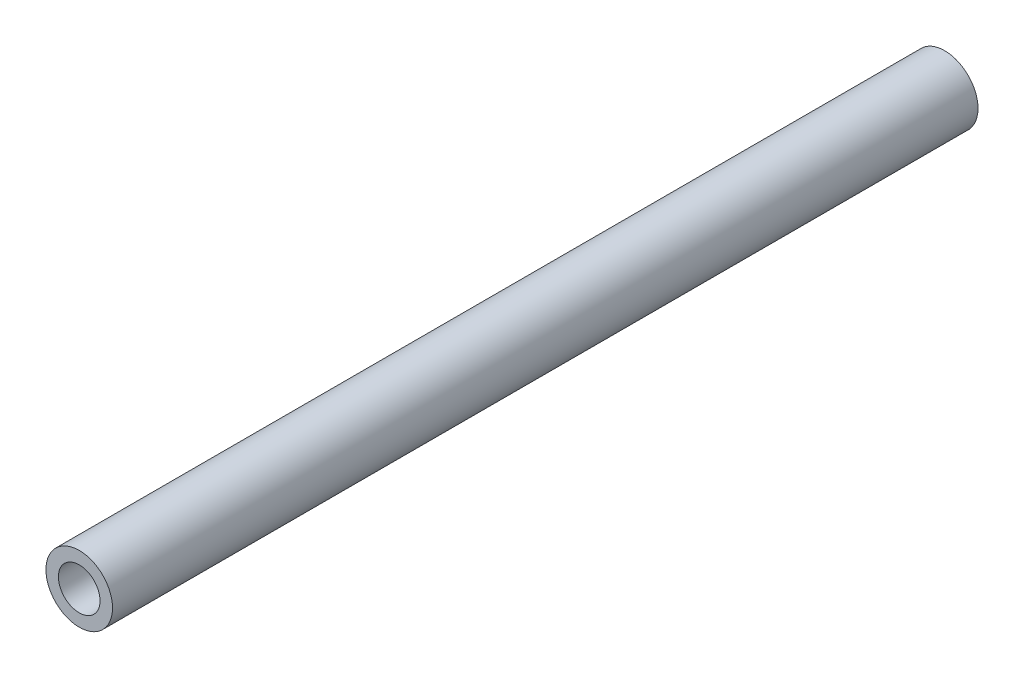
ISO-10303-21;
HEADER;
FILE_DESCRIPTION(('STEP AP214'),'2;1');
FILE_NAME('part.step','',(''),(''),'','','');
FILE_SCHEMA(('AUTOMOTIVE_DESIGN { 1 0 10303 214 1 1 1 1 }'));
ENDSEC;
DATA;
#1=APPLICATION_CONTEXT('core data for automotive mechanical design processes');
#2=APPLICATION_PROTOCOL_DEFINITION('international standard','automotive_design',2000,#1);
#3=PRODUCT_CONTEXT('',#1,'mechanical');
#4=PRODUCT('Part','Part','',(#3));
#5=PRODUCT_RELATED_PRODUCT_CATEGORY('part','',(#4));
#6=PRODUCT_DEFINITION_FORMATION('','',#4);
#7=PRODUCT_DEFINITION_CONTEXT('part definition',#1,'design');
#8=PRODUCT_DEFINITION('design','',#6,#7);
#9=PRODUCT_DEFINITION_SHAPE('','',#8);
#10=(LENGTH_UNIT() NAMED_UNIT(*) SI_UNIT(.MILLI.,.METRE.));
#11=(NAMED_UNIT(*) PLANE_ANGLE_UNIT() SI_UNIT($,.RADIAN.));
#12=(NAMED_UNIT(*) SI_UNIT($,.STERADIAN.) SOLID_ANGLE_UNIT());
#13=UNCERTAINTY_MEASURE_WITH_UNIT(LENGTH_MEASURE(1.E-05),#10,'distance_accuracy_value','');
#14=(GEOMETRIC_REPRESENTATION_CONTEXT(3) GLOBAL_UNCERTAINTY_ASSIGNED_CONTEXT((#13)) GLOBAL_UNIT_ASSIGNED_CONTEXT((#10,
#11,#12)) REPRESENTATION_CONTEXT('',''));
#15=CARTESIAN_POINT('',(0.,0.,0.));
#16=DIRECTION('',(0.,0.,1.));
#17=DIRECTION('',(1.,0.,0.));
#18=AXIS2_PLACEMENT_3D('',#15,#16,#17);
#19=CARTESIAN_POINT('',(0.,0.,104.));
#20=DIRECTION('',(0.,0.,1.));
#21=DIRECTION('',(1.,0.,0.));
#22=AXIS2_PLACEMENT_3D('',#19,#20,#21);
#23=PLANE('',#22);
#24=CARTESIAN_POINT('',(0.,0.,104.));
#25=DIRECTION('',(0.,0.,1.));
#26=DIRECTION('',(1.,0.,0.));
#27=AXIS2_PLACEMENT_3D('',#24,#25,#26);
#28=CIRCLE('',#27,4.);
#29=CARTESIAN_POINT('',(4.,0.,104.));
#30=VERTEX_POINT('',#29);
#31=EDGE_CURVE('E10',#30,#30,#28,.T.);
#32=ORIENTED_EDGE('',*,*,#31,.T.);
#33=EDGE_LOOP('',(#32));
#34=FACE_BOUND('',#33,.T.);
#35=CARTESIAN_POINT('',(0.,0.,104.));
#36=DIRECTION('',(0.,0.,1.));
#37=DIRECTION('',(1.,0.,0.));
#38=AXIS2_PLACEMENT_3D('',#35,#36,#37);
#39=CIRCLE('',#38,2.5);
#40=CARTESIAN_POINT('',(2.5,0.,104.));
#41=VERTEX_POINT('',#40);
#42=EDGE_CURVE('E43',#41,#41,#39,.T.);
#43=ORIENTED_EDGE('',*,*,#42,.F.);
#44=EDGE_LOOP('',(#43));
#45=FACE_BOUND('',#44,.T.);
#46=ADVANCED_FACE('F32',(#34,#45),#23,.T.);
#47=CARTESIAN_POINT('',(0.,0.,0.));
#48=DIRECTION('',(0.,0.,1.));
#49=DIRECTION('',(1.,0.,0.));
#50=AXIS2_PLACEMENT_3D('',#47,#48,#49);
#51=PLANE('',#50);
#52=CARTESIAN_POINT('',(0.,0.,0.));
#53=DIRECTION('',(0.,0.,1.));
#54=DIRECTION('',(1.,0.,0.));
#55=AXIS2_PLACEMENT_3D('',#52,#53,#54);
#56=CIRCLE('',#55,4.);
#57=CARTESIAN_POINT('',(4.,0.,0.));
#58=VERTEX_POINT('',#57);
#59=EDGE_CURVE('E36',#58,#58,#56,.T.);
#60=ORIENTED_EDGE('',*,*,#59,.F.);
#61=EDGE_LOOP('',(#60));
#62=FACE_BOUND('',#61,.T.);
#63=CARTESIAN_POINT('',(0.,0.,0.));
#64=DIRECTION('',(0.,0.,1.));
#65=DIRECTION('',(1.,0.,0.));
#66=AXIS2_PLACEMENT_3D('',#63,#64,#65);
#67=CIRCLE('',#66,2.5);
#68=CARTESIAN_POINT('',(2.5,0.,0.));
#69=VERTEX_POINT('',#68);
#70=EDGE_CURVE('E45',#69,#69,#67,.T.);
#71=ORIENTED_EDGE('',*,*,#70,.T.);
#72=EDGE_LOOP('',(#71));
#73=FACE_BOUND('',#72,.T.);
#74=ADVANCED_FACE('F55',(#62,#73),#51,.F.);
#75=CARTESIAN_POINT('',(0.,0.,104.));
#76=DIRECTION('',(0.,0.,-1.));
#77=DIRECTION('',(-1.,0.,0.));
#78=AXIS2_PLACEMENT_3D('',#75,#76,#77);
#79=CYLINDRICAL_SURFACE('',#78,4.);
#80=ORIENTED_EDGE('',*,*,#31,.F.);
#81=EDGE_LOOP('',(#80));
#82=FACE_BOUND('',#81,.T.);
#83=ORIENTED_EDGE('',*,*,#59,.T.);
#84=EDGE_LOOP('',(#83));
#85=FACE_BOUND('',#84,.T.);
#86=ADVANCED_FACE('F34',(#82,#85),#79,.T.);
#87=CARTESIAN_POINT('',(0.,0.,104.));
#88=DIRECTION('',(0.,0.,-1.));
#89=DIRECTION('',(-1.,0.,0.));
#90=AXIS2_PLACEMENT_3D('',#87,#88,#89);
#91=CYLINDRICAL_SURFACE('',#90,2.5);
#92=ORIENTED_EDGE('',*,*,#42,.T.);
#93=EDGE_LOOP('',(#92));
#94=FACE_BOUND('',#93,.T.);
#95=ORIENTED_EDGE('',*,*,#70,.F.);
#96=EDGE_LOOP('',(#95));
#97=FACE_BOUND('',#96,.T.);
#98=ADVANCED_FACE('F51',(#94,#97),#91,.F.);
#99=CLOSED_SHELL('',(#46,#74,#86,#98));
#100=MANIFOLD_SOLID_BREP('B2',#99);
#101=ADVANCED_BREP_SHAPE_REPRESENTATION('',(#18,#100),#14);
#102=SHAPE_DEFINITION_REPRESENTATION(#9,#101);
ENDSEC;
END-ISO-10303-21;
